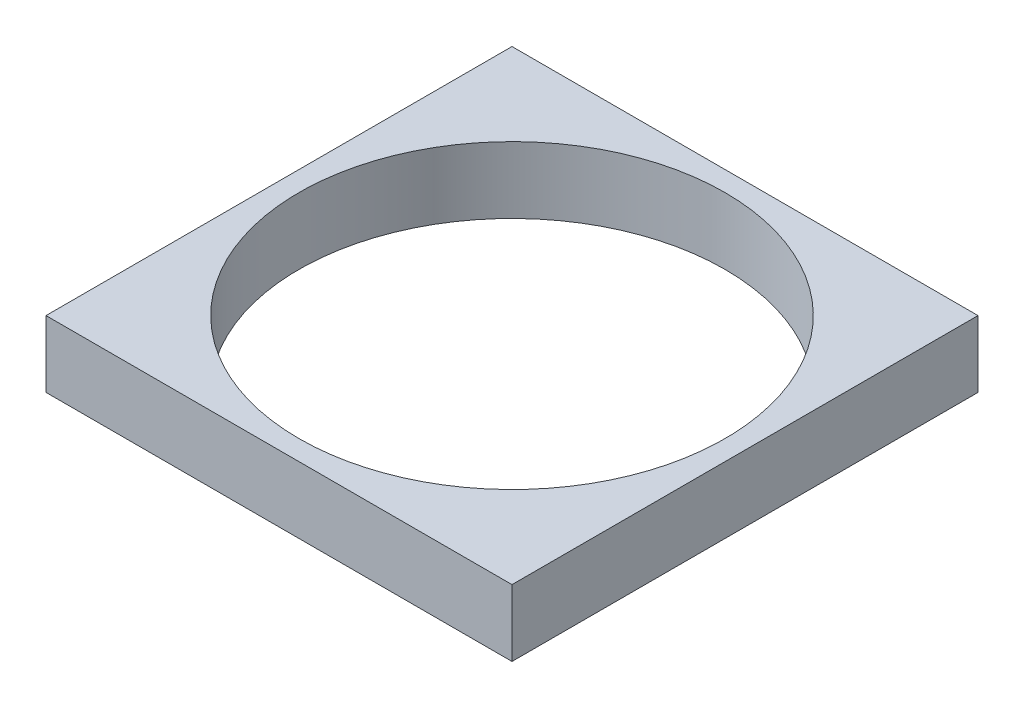
ISO-10303-21;
HEADER;
FILE_DESCRIPTION(('STEP AP214'),'2;1');
FILE_NAME('part.step','',(''),(''),'','','');
FILE_SCHEMA(('AUTOMOTIVE_DESIGN { 1 0 10303 214 1 1 1 1 }'));
ENDSEC;
DATA;
#1=APPLICATION_CONTEXT('core data for automotive mechanical design processes');
#2=APPLICATION_PROTOCOL_DEFINITION('international standard','automotive_design',2000,#1);
#3=PRODUCT_CONTEXT('',#1,'mechanical');
#4=PRODUCT('Part','Part','',(#3));
#5=PRODUCT_RELATED_PRODUCT_CATEGORY('part','',(#4));
#6=PRODUCT_DEFINITION_FORMATION('','',#4);
#7=PRODUCT_DEFINITION_CONTEXT('part definition',#1,'design');
#8=PRODUCT_DEFINITION('design','',#6,#7);
#9=PRODUCT_DEFINITION_SHAPE('','',#8);
#10=(LENGTH_UNIT() NAMED_UNIT(*) SI_UNIT(.MILLI.,.METRE.));
#11=(NAMED_UNIT(*) PLANE_ANGLE_UNIT() SI_UNIT($,.RADIAN.));
#12=(NAMED_UNIT(*) SI_UNIT($,.STERADIAN.) SOLID_ANGLE_UNIT());
#13=UNCERTAINTY_MEASURE_WITH_UNIT(LENGTH_MEASURE(1.E-05),#10,'distance_accuracy_value','');
#14=(GEOMETRIC_REPRESENTATION_CONTEXT(3) GLOBAL_UNCERTAINTY_ASSIGNED_CONTEXT((#13)) GLOBAL_UNIT_ASSIGNED_CONTEXT((#10,
#11,#12)) REPRESENTATION_CONTEXT('',''));
#15=CARTESIAN_POINT('',(0.,0.,0.));
#16=DIRECTION('',(0.,0.,1.));
#17=DIRECTION('',(1.,0.,0.));
#18=AXIS2_PLACEMENT_3D('',#15,#16,#17);
#19=CARTESIAN_POINT('',(0.,10.,0.));
#20=DIRECTION('',(0.,-1.,0.));
#21=DIRECTION('',(0.,0.,-1.));
#22=AXIS2_PLACEMENT_3D('',#19,#20,#21);
#23=PLANE('',#22);
#24=DIRECTION('',(0.,0.,-1.));
#25=VECTOR('',#24,1.);
#26=CARTESIAN_POINT('',(35.,10.,35.));
#27=LINE('',#26,#25);
#28=CARTESIAN_POINT('',(35.,10.,35.));
#29=VERTEX_POINT('',#28);
#30=CARTESIAN_POINT('',(35.,10.,-35.));
#31=VERTEX_POINT('',#30);
#32=EDGE_CURVE('E87',#29,#31,#27,.T.);
#33=ORIENTED_EDGE('',*,*,#32,.T.);
#34=DIRECTION('',(-1.,0.,0.));
#35=VECTOR('',#34,1.);
#36=CARTESIAN_POINT('',(-35.,10.,-35.));
#37=LINE('',#36,#35);
#38=CARTESIAN_POINT('',(-35.,10.,-35.));
#39=VERTEX_POINT('',#38);
#40=EDGE_CURVE('E82',#31,#39,#37,.T.);
#41=ORIENTED_EDGE('',*,*,#40,.T.);
#42=DIRECTION('',(0.,0.,1.));
#43=VECTOR('',#42,1.);
#44=CARTESIAN_POINT('',(-35.,10.,35.));
#45=LINE('',#44,#43);
#46=CARTESIAN_POINT('',(-35.,10.,35.));
#47=VERTEX_POINT('',#46);
#48=EDGE_CURVE('E85',#39,#47,#45,.T.);
#49=ORIENTED_EDGE('',*,*,#48,.T.);
#50=DIRECTION('',(1.,0.,0.));
#51=VECTOR('',#50,1.);
#52=CARTESIAN_POINT('',(-35.,10.,35.));
#53=LINE('',#52,#51);
#54=EDGE_CURVE('E52',#47,#29,#53,.T.);
#55=ORIENTED_EDGE('',*,*,#54,.T.);
#56=EDGE_LOOP('',(#33,#41,#49,#55));
#57=FACE_BOUND('',#56,.T.);
#58=CARTESIAN_POINT('',(0.,10.,0.));
#59=DIRECTION('',(0.,1.,0.));
#60=DIRECTION('',(0.,0.,1.));
#61=AXIS2_PLACEMENT_3D('',#58,#59,#60);
#62=CIRCLE('',#61,32.004);
#63=CARTESIAN_POINT('',(0.,10.,32.004));
#64=VERTEX_POINT('',#63);
#65=EDGE_CURVE('E102',#64,#64,#62,.T.);
#66=ORIENTED_EDGE('',*,*,#65,.F.);
#67=EDGE_LOOP('',(#66));
#68=FACE_BOUND('',#67,.T.);
#69=ADVANCED_FACE('F35',(#57,#68),#23,.F.);
#70=CARTESIAN_POINT('',(0.,0.,0.));
#71=DIRECTION('',(0.,-1.,0.));
#72=DIRECTION('',(0.,0.,-1.));
#73=AXIS2_PLACEMENT_3D('',#70,#71,#72);
#74=PLANE('',#73);
#75=DIRECTION('',(0.,0.,-1.));
#76=VECTOR('',#75,1.);
#77=CARTESIAN_POINT('',(35.,0.,35.));
#78=LINE('',#77,#76);
#79=CARTESIAN_POINT('',(35.,0.,35.));
#80=VERTEX_POINT('',#79);
#81=CARTESIAN_POINT('',(35.,0.,-35.));
#82=VERTEX_POINT('',#81);
#83=EDGE_CURVE('E99',#80,#82,#78,.T.);
#84=ORIENTED_EDGE('',*,*,#83,.F.);
#85=DIRECTION('',(1.,0.,0.));
#86=VECTOR('',#85,1.);
#87=CARTESIAN_POINT('',(-35.,0.,35.));
#88=LINE('',#87,#86);
#89=CARTESIAN_POINT('',(-35.,0.,35.));
#90=VERTEX_POINT('',#89);
#91=EDGE_CURVE('E75',#90,#80,#88,.T.);
#92=ORIENTED_EDGE('',*,*,#91,.F.);
#93=DIRECTION('',(0.,0.,1.));
#94=VECTOR('',#93,1.);
#95=CARTESIAN_POINT('',(-35.,0.,35.));
#96=LINE('',#95,#94);
#97=CARTESIAN_POINT('',(-35.,0.,-35.));
#98=VERTEX_POINT('',#97);
#99=EDGE_CURVE('E69',#98,#90,#96,.T.);
#100=ORIENTED_EDGE('',*,*,#99,.F.);
#101=DIRECTION('',(-1.,0.,0.));
#102=VECTOR('',#101,1.);
#103=CARTESIAN_POINT('',(-35.,0.,-35.));
#104=LINE('',#103,#102);
#105=EDGE_CURVE('E91',#82,#98,#104,.T.);
#106=ORIENTED_EDGE('',*,*,#105,.F.);
#107=EDGE_LOOP('',(#84,#92,#100,#106));
#108=FACE_BOUND('',#107,.T.);
#109=CARTESIAN_POINT('',(0.,0.,0.));
#110=DIRECTION('',(0.,1.,0.));
#111=DIRECTION('',(0.,0.,1.));
#112=AXIS2_PLACEMENT_3D('',#109,#110,#111);
#113=CIRCLE('',#112,32.004);
#114=CARTESIAN_POINT('',(0.,0.,32.004));
#115=VERTEX_POINT('',#114);
#116=EDGE_CURVE('E114',#115,#115,#113,.T.);
#117=ORIENTED_EDGE('',*,*,#116,.T.);
#118=EDGE_LOOP('',(#117));
#119=FACE_BOUND('',#118,.T.);
#120=ADVANCED_FACE('F110',(#108,#119),#74,.T.);
#121=CARTESIAN_POINT('',(35.,10.,35.));
#122=DIRECTION('',(-1.,0.,0.));
#123=DIRECTION('',(0.,0.,1.));
#124=AXIS2_PLACEMENT_3D('',#121,#122,#123);
#125=PLANE('',#124);
#126=ORIENTED_EDGE('',*,*,#83,.T.);
#127=DIRECTION('',(0.,-1.,0.));
#128=VECTOR('',#127,1.);
#129=CARTESIAN_POINT('',(35.,10.,-35.));
#130=LINE('',#129,#128);
#131=EDGE_CURVE('E11',#31,#82,#130,.T.);
#132=ORIENTED_EDGE('',*,*,#131,.F.);
#133=ORIENTED_EDGE('',*,*,#32,.F.);
#134=DIRECTION('',(0.,-1.,0.));
#135=VECTOR('',#134,1.);
#136=CARTESIAN_POINT('',(35.,10.,35.));
#137=LINE('',#136,#135);
#138=EDGE_CURVE('E95',#29,#80,#137,.T.);
#139=ORIENTED_EDGE('',*,*,#138,.T.);
#140=EDGE_LOOP('',(#126,#132,#133,#139));
#141=FACE_BOUND('',#140,.T.);
#142=ADVANCED_FACE('F37',(#141),#125,.F.);
#143=CARTESIAN_POINT('',(-35.,10.,-35.));
#144=DIRECTION('',(0.,0.,1.));
#145=DIRECTION('',(1.,0.,0.));
#146=AXIS2_PLACEMENT_3D('',#143,#144,#145);
#147=PLANE('',#146);
#148=ORIENTED_EDGE('',*,*,#105,.T.);
#149=DIRECTION('',(0.,-1.,0.));
#150=VECTOR('',#149,1.);
#151=CARTESIAN_POINT('',(-35.,10.,-35.));
#152=LINE('',#151,#150);
#153=EDGE_CURVE('E44',#39,#98,#152,.T.);
#154=ORIENTED_EDGE('',*,*,#153,.F.);
#155=ORIENTED_EDGE('',*,*,#40,.F.);
#156=ORIENTED_EDGE('',*,*,#131,.T.);
#157=EDGE_LOOP('',(#148,#154,#155,#156));
#158=FACE_BOUND('',#157,.T.);
#159=ADVANCED_FACE('F90',(#158),#147,.F.);
#160=CARTESIAN_POINT('',(-35.,10.,35.));
#161=DIRECTION('',(1.,0.,0.));
#162=DIRECTION('',(0.,0.,-1.));
#163=AXIS2_PLACEMENT_3D('',#160,#161,#162);
#164=PLANE('',#163);
#165=ORIENTED_EDGE('',*,*,#99,.T.);
#166=DIRECTION('',(0.,-1.,0.));
#167=VECTOR('',#166,1.);
#168=CARTESIAN_POINT('',(-35.,10.,35.));
#169=LINE('',#168,#167);
#170=EDGE_CURVE('E92',#47,#90,#169,.T.);
#171=ORIENTED_EDGE('',*,*,#170,.F.);
#172=ORIENTED_EDGE('',*,*,#48,.F.);
#173=ORIENTED_EDGE('',*,*,#153,.T.);
#174=EDGE_LOOP('',(#165,#171,#172,#173));
#175=FACE_BOUND('',#174,.T.);
#176=ADVANCED_FACE('F93',(#175),#164,.F.);
#177=CARTESIAN_POINT('',(-35.,10.,35.));
#178=DIRECTION('',(0.,0.,-1.));
#179=DIRECTION('',(-1.,0.,0.));
#180=AXIS2_PLACEMENT_3D('',#177,#178,#179);
#181=PLANE('',#180);
#182=ORIENTED_EDGE('',*,*,#91,.T.);
#183=ORIENTED_EDGE('',*,*,#138,.F.);
#184=ORIENTED_EDGE('',*,*,#54,.F.);
#185=ORIENTED_EDGE('',*,*,#170,.T.);
#186=EDGE_LOOP('',(#182,#183,#184,#185));
#187=FACE_BOUND('',#186,.T.);
#188=ADVANCED_FACE('F107',(#187),#181,.F.);
#189=CARTESIAN_POINT('',(0.,10.,0.));
#190=DIRECTION('',(0.,-1.,0.));
#191=DIRECTION('',(0.,0.,-1.));
#192=AXIS2_PLACEMENT_3D('',#189,#190,#191);
#193=CYLINDRICAL_SURFACE('',#192,32.004);
#194=ORIENTED_EDGE('',*,*,#65,.T.);
#195=EDGE_LOOP('',(#194));
#196=FACE_BOUND('',#195,.T.);
#197=ORIENTED_EDGE('',*,*,#116,.F.);
#198=EDGE_LOOP('',(#197));
#199=FACE_BOUND('',#198,.T.);
#200=ADVANCED_FACE('F120',(#196,#199),#193,.F.);
#201=CLOSED_SHELL('',(#69,#120,#142,#159,#176,#188,#200));
#202=MANIFOLD_SOLID_BREP('B2',#201);
#203=ADVANCED_BREP_SHAPE_REPRESENTATION('',(#18,#202),#14);
#204=SHAPE_DEFINITION_REPRESENTATION(#9,#203);
ENDSEC;
END-ISO-10303-21;
